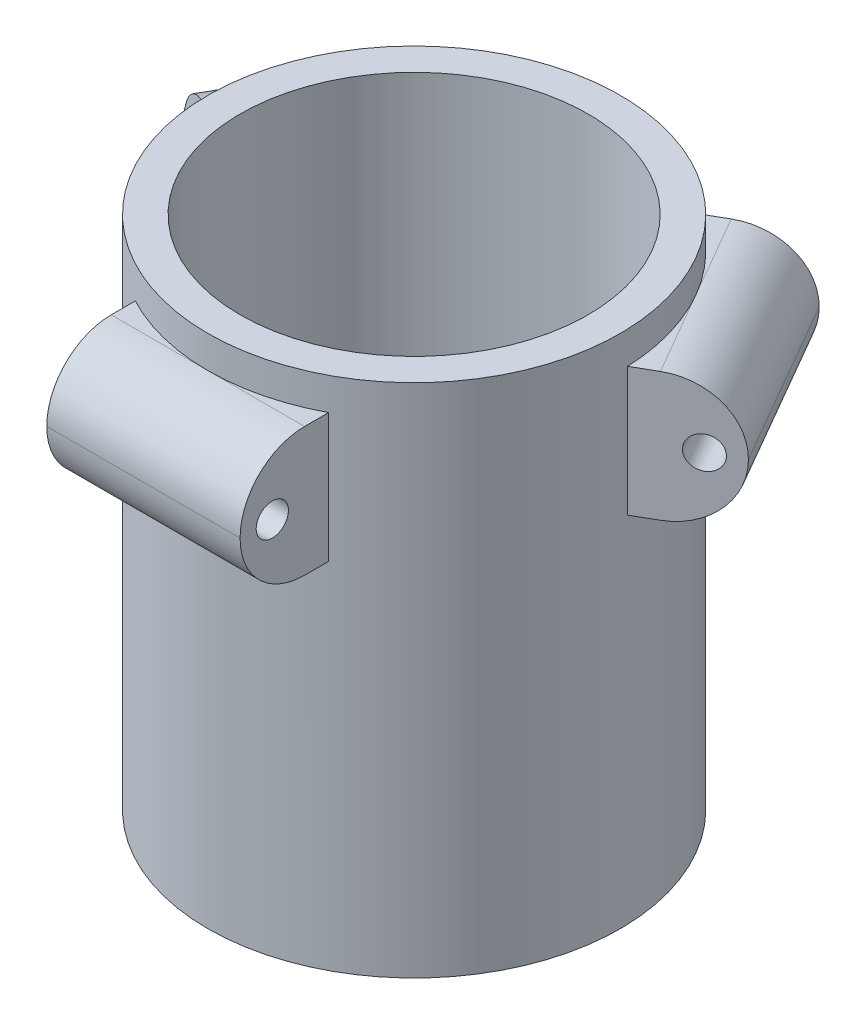
ISO-10303-21;
HEADER;
FILE_DESCRIPTION(('STEP AP214'),'2;1');
FILE_NAME('part.step','',(''),(''),'','','');
FILE_SCHEMA(('AUTOMOTIVE_DESIGN { 1 0 10303 214 1 1 1 1 }'));
ENDSEC;
DATA;
#1=APPLICATION_CONTEXT('core data for automotive mechanical design processes');
#2=APPLICATION_PROTOCOL_DEFINITION('international standard','automotive_design',2000,#1);
#3=PRODUCT_CONTEXT('',#1,'mechanical');
#4=PRODUCT('Part','Part','',(#3));
#5=PRODUCT_RELATED_PRODUCT_CATEGORY('part','',(#4));
#6=PRODUCT_DEFINITION_FORMATION('','',#4);
#7=PRODUCT_DEFINITION_CONTEXT('part definition',#1,'design');
#8=PRODUCT_DEFINITION('design','',#6,#7);
#9=PRODUCT_DEFINITION_SHAPE('','',#8);
#10=(LENGTH_UNIT() NAMED_UNIT(*) SI_UNIT(.MILLI.,.METRE.));
#11=(NAMED_UNIT(*) PLANE_ANGLE_UNIT() SI_UNIT($,.RADIAN.));
#12=(NAMED_UNIT(*) SI_UNIT($,.STERADIAN.) SOLID_ANGLE_UNIT());
#13=UNCERTAINTY_MEASURE_WITH_UNIT(LENGTH_MEASURE(1.E-05),#10,'distance_accuracy_value','');
#14=(GEOMETRIC_REPRESENTATION_CONTEXT(3) GLOBAL_UNCERTAINTY_ASSIGNED_CONTEXT((#13)) GLOBAL_UNIT_ASSIGNED_CONTEXT((#10,
#11,#12)) REPRESENTATION_CONTEXT('',''));
#15=CARTESIAN_POINT('',(0.,0.,0.));
#16=DIRECTION('',(0.,0.,1.));
#17=DIRECTION('',(1.,0.,0.));
#18=AXIS2_PLACEMENT_3D('',#15,#16,#17);
#19=CARTESIAN_POINT('',(0.,34.925,0.));
#20=DIRECTION('',(0.,-1.,0.));
#21=DIRECTION('',(0.866025403784443,0.,0.499999999999992));
#22=AXIS2_PLACEMENT_3D('',#19,#20,#21);
#23=PLANE('',#22);
#24=DIRECTION('',(-0.866025403784443,0.,-0.499999999999992));
#25=VECTOR('',#24,1.);
#26=CARTESIAN_POINT('',(-4.76249999999992,34.925,8.24889197104682));
#27=LINE('',#26,#25);
#28=CARTESIAN_POINT('',(-20.3070354144149,34.925,-0.725749734893167));
#29=VERTEX_POINT('',#28);
#30=CARTESIAN_POINT('',(-22.3601362048998,34.925,-1.91110802895301));
#31=VERTEX_POINT('',#30);
#32=EDGE_CURVE('E180',#29,#31,#27,.T.);
#33=ORIENTED_EDGE('',*,*,#32,.T.);
#34=DIRECTION('',(0.499999999999992,0.,-0.866025403784443));
#35=VECTOR('',#34,1.);
#36=CARTESIAN_POINT('',(-17.5976362048999,34.925,-10.1599999999998));
#37=LINE('',#36,#35);
#38=CARTESIAN_POINT('',(-17.5976362048999,34.925,-10.1599999999998));
#39=VERTEX_POINT('',#38);
#40=EDGE_CURVE('E11',#31,#39,#37,.T.);
#41=ORIENTED_EDGE('',*,*,#40,.T.);
#42=CARTESIAN_POINT('',(0.,34.925,0.));
#43=DIRECTION('',(0.,-1.,0.));
#44=DIRECTION('',(0.866025403784443,0.,0.499999999999992));
#45=AXIS2_PLACEMENT_3D('',#42,#43,#44);
#46=CIRCLE('',#45,20.32);
#47=EDGE_CURVE('E337',#29,#39,#46,.T.);
#48=ORIENTED_EDGE('',*,*,#47,.F.);
#49=EDGE_LOOP('',(#33,#41,#48));
#50=FACE_BOUND('',#49,.T.);
#51=ADVANCED_FACE('F34',(#50),#23,.T.);
#52=CARTESIAN_POINT('',(0.,47.625,0.));
#53=DIRECTION('',(0.,-1.,0.));
#54=DIRECTION('',(0.866025403784443,0.,0.499999999999992));
#55=AXIS2_PLACEMENT_3D('',#52,#53,#54);
#56=PLANE('',#55);
#57=DIRECTION('',(-0.866025403784443,0.,-0.499999999999992));
#58=VECTOR('',#57,1.);
#59=CARTESIAN_POINT('',(4.76249999999992,47.625,-8.24889197104681));
#60=LINE('',#59,#58);
#61=CARTESIAN_POINT('',(-10.7820354144151,47.625,-17.2235336769868));
#62=VERTEX_POINT('',#61);
#63=CARTESIAN_POINT('',(-12.8351362049,47.625,-18.4088919710467));
#64=VERTEX_POINT('',#63);
#65=EDGE_CURVE('E164',#62,#64,#60,.T.);
#66=ORIENTED_EDGE('',*,*,#65,.T.);
#67=DIRECTION('',(0.499999999999992,0.,-0.866025403784443));
#68=VECTOR('',#67,1.);
#69=CARTESIAN_POINT('',(-22.3601362048998,47.625,-1.91110802895302));
#70=LINE('',#69,#68);
#71=CARTESIAN_POINT('',(-17.5976362048999,47.625,-10.1599999999998));
#72=VERTEX_POINT('',#71);
#73=EDGE_CURVE('E166',#64,#72,#70,.F.);
#74=ORIENTED_EDGE('',*,*,#73,.T.);
#75=CARTESIAN_POINT('',(0.,47.625,0.));
#76=DIRECTION('',(0.,-1.,0.));
#77=DIRECTION('',(0.866025403784443,0.,0.499999999999992));
#78=AXIS2_PLACEMENT_3D('',#75,#76,#77);
#79=CIRCLE('',#78,20.32);
#80=EDGE_CURVE('E161',#72,#62,#79,.T.);
#81=ORIENTED_EDGE('',*,*,#80,.T.);
#82=EDGE_LOOP('',(#66,#74,#81));
#83=FACE_BOUND('',#82,.T.);
#84=ADVANCED_FACE('F163',(#83),#56,.F.);
#85=CARTESIAN_POINT('',(0.,34.925,0.));
#86=DIRECTION('',(0.,-1.,0.));
#87=DIRECTION('',(-0.866025403784436,0.,0.500000000000004));
#88=AXIS2_PLACEMENT_3D('',#85,#86,#87);
#89=PLANE('',#88);
#90=DIRECTION('',(0.866025403784436,0.,-0.500000000000004));
#91=VECTOR('',#90,1.);
#92=CARTESIAN_POINT('',(-4.76250000000004,34.925,-8.24889197104676));
#93=LINE('',#92,#91);
#94=CARTESIAN_POINT('',(10.7820354144149,34.925,-17.223533676987));
#95=VERTEX_POINT('',#94);
#96=CARTESIAN_POINT('',(12.8351362048997,34.925,-18.4088919710468));
#97=VERTEX_POINT('',#96);
#98=EDGE_CURVE('E199',#95,#97,#93,.T.);
#99=ORIENTED_EDGE('',*,*,#98,.T.);
#100=DIRECTION('',(0.500000000000004,0.,0.866025403784436));
#101=VECTOR('',#100,1.);
#102=CARTESIAN_POINT('',(17.5976362048998,34.925,-10.1600000000001));
#103=LINE('',#102,#101);
#104=CARTESIAN_POINT('',(17.5976362048998,34.925,-10.1600000000001));
#105=VERTEX_POINT('',#104);
#106=EDGE_CURVE('E305',#97,#105,#103,.T.);
#107=ORIENTED_EDGE('',*,*,#106,.T.);
#108=CARTESIAN_POINT('',(0.,34.925,0.));
#109=DIRECTION('',(0.,-1.,0.));
#110=DIRECTION('',(-0.866025403784436,0.,0.500000000000004));
#111=AXIS2_PLACEMENT_3D('',#108,#109,#110);
#112=CIRCLE('',#111,20.32);
#113=EDGE_CURVE('E210',#95,#105,#112,.T.);
#114=ORIENTED_EDGE('',*,*,#113,.F.);
#115=EDGE_LOOP('',(#99,#107,#114));
#116=FACE_BOUND('',#115,.T.);
#117=ADVANCED_FACE('F345',(#116),#89,.T.);
#118=CARTESIAN_POINT('',(0.,47.625,0.));
#119=DIRECTION('',(0.,-1.,0.));
#120=DIRECTION('',(-0.866025403784436,0.,0.500000000000004));
#121=AXIS2_PLACEMENT_3D('',#118,#119,#120);
#122=PLANE('',#121);
#123=DIRECTION('',(0.866025403784437,0.,-0.500000000000004));
#124=VECTOR('',#123,1.);
#125=CARTESIAN_POINT('',(4.76250000000003,47.625,8.24889197104675));
#126=LINE('',#125,#124);
#127=CARTESIAN_POINT('',(20.3070354144149,47.625,-0.725749734893456));
#128=VERTEX_POINT('',#127);
#129=CARTESIAN_POINT('',(22.3601362048998,47.625,-1.91110802895334));
#130=VERTEX_POINT('',#129);
#131=EDGE_CURVE('E195',#128,#130,#126,.T.);
#132=ORIENTED_EDGE('',*,*,#131,.T.);
#133=DIRECTION('',(0.500000000000004,0.,0.866025403784436));
#134=VECTOR('',#133,1.);
#135=CARTESIAN_POINT('',(12.8351362048997,47.625,-18.4088919710468));
#136=LINE('',#135,#134);
#137=CARTESIAN_POINT('',(17.5976362048998,47.625,-10.1600000000001));
#138=VERTEX_POINT('',#137);
#139=EDGE_CURVE('E296',#130,#138,#136,.F.);
#140=ORIENTED_EDGE('',*,*,#139,.T.);
#141=CARTESIAN_POINT('',(0.,47.625,0.));
#142=DIRECTION('',(0.,-1.,0.));
#143=DIRECTION('',(-0.866025403784436,0.,0.500000000000004));
#144=AXIS2_PLACEMENT_3D('',#141,#142,#143);
#145=CIRCLE('',#144,20.32);
#146=EDGE_CURVE('E198',#138,#128,#145,.T.);
#147=ORIENTED_EDGE('',*,*,#146,.T.);
#148=EDGE_LOOP('',(#132,#140,#147));
#149=FACE_BOUND('',#148,.T.);
#150=ADVANCED_FACE('F401',(#149),#122,.F.);
#151=CARTESIAN_POINT('',(0.,50.8,0.));
#152=DIRECTION('',(0.,-1.,0.));
#153=DIRECTION('',(0.,0.,-1.));
#154=AXIS2_PLACEMENT_3D('',#151,#152,#153);
#155=CYLINDRICAL_SURFACE('',#154,20.32);
#156=CARTESIAN_POINT('',(10.7820354144149,47.625,-17.223533676987));
#157=VERTEX_POINT('',#156);
#158=EDGE_CURVE('E200',#157,#138,#145,.T.);
#159=ORIENTED_EDGE('',*,*,#158,.F.);
#160=DIRECTION('',(0.,-1.,0.));
#161=VECTOR('',#160,1.);
#162=CARTESIAN_POINT('',(10.7820354144149,47.625,-17.223533676987));
#163=LINE('',#162,#161);
#164=EDGE_CURVE('E215',#157,#95,#163,.T.);
#165=ORIENTED_EDGE('',*,*,#164,.T.);
#166=ORIENTED_EDGE('',*,*,#113,.T.);
#167=CARTESIAN_POINT('',(20.3070354144149,34.925,-0.725749734893449));
#168=VERTEX_POINT('',#167);
#169=EDGE_CURVE('E209',#105,#168,#112,.T.);
#170=ORIENTED_EDGE('',*,*,#169,.T.);
#171=DIRECTION('',(0.,-1.,0.));
#172=VECTOR('',#171,1.);
#173=CARTESIAN_POINT('',(20.3070354144149,47.625,-0.725749734893456));
#174=LINE('',#173,#172);
#175=EDGE_CURVE('E206',#128,#168,#174,.T.);
#176=ORIENTED_EDGE('',*,*,#175,.F.);
#177=ORIENTED_EDGE('',*,*,#146,.F.);
#178=EDGE_LOOP('',(#159,#165,#166,#170,#176,#177));
#179=FACE_BOUND('',#178,.T.);
#180=CARTESIAN_POINT('',(0.,0.,0.));
#181=DIRECTION('',(0.,1.,0.));
#182=DIRECTION('',(0.,0.,1.));
#183=AXIS2_PLACEMENT_3D('',#180,#181,#182);
#184=CIRCLE('',#183,20.32);
#185=CARTESIAN_POINT('',(0.,0.,20.32));
#186=VERTEX_POINT('',#185);
#187=EDGE_CURVE('E263',#186,#186,#184,.T.);
#188=ORIENTED_EDGE('',*,*,#187,.T.);
#189=EDGE_LOOP('',(#188));
#190=FACE_BOUND('',#189,.T.);
#191=CARTESIAN_POINT('',(0.,50.8,0.));
#192=DIRECTION('',(0.,1.,0.));
#193=DIRECTION('',(0.,0.,1.));
#194=AXIS2_PLACEMENT_3D('',#191,#192,#193);
#195=CIRCLE('',#194,20.32);
#196=CARTESIAN_POINT('',(0.,50.8,20.32));
#197=VERTEX_POINT('',#196);
#198=EDGE_CURVE('E264',#197,#197,#195,.T.);
#199=ORIENTED_EDGE('',*,*,#198,.F.);
#200=EDGE_LOOP('',(#199));
#201=FACE_BOUND('',#200,.T.);
#202=CARTESIAN_POINT('',(0.,47.625,0.));
#203=DIRECTION('',(0.,-1.,0.));
#204=DIRECTION('',(0.,0.,-1.));
#205=AXIS2_PLACEMENT_3D('',#202,#203,#204);
#206=CIRCLE('',#205,20.32);
#207=CARTESIAN_POINT('',(9.525,47.625,17.9492834118803));
#208=VERTEX_POINT('',#207);
#209=CARTESIAN_POINT('',(0.,47.625,20.32));
#210=VERTEX_POINT('',#209);
#211=EDGE_CURVE('E233',#208,#210,#206,.T.);
#212=ORIENTED_EDGE('',*,*,#211,.F.);
#213=DIRECTION('',(0.,-1.,0.));
#214=VECTOR('',#213,1.);
#215=CARTESIAN_POINT('',(9.525,47.625,17.9492834118803));
#216=LINE('',#215,#214);
#217=CARTESIAN_POINT('',(9.525,34.925,17.9492834118803));
#218=VERTEX_POINT('',#217);
#219=EDGE_CURVE('E248',#208,#218,#216,.T.);
#220=ORIENTED_EDGE('',*,*,#219,.T.);
#221=CARTESIAN_POINT('',(0.,34.925,0.));
#222=DIRECTION('',(0.,-1.,0.));
#223=DIRECTION('',(0.,0.,-1.));
#224=AXIS2_PLACEMENT_3D('',#221,#222,#223);
#225=CIRCLE('',#224,20.32);
#226=CARTESIAN_POINT('',(0.,34.925,20.32));
#227=VERTEX_POINT('',#226);
#228=EDGE_CURVE('E243',#218,#227,#225,.T.);
#229=ORIENTED_EDGE('',*,*,#228,.T.);
#230=CARTESIAN_POINT('',(-9.525,34.925,17.9492834118803));
#231=VERTEX_POINT('',#230);
#232=EDGE_CURVE('E242',#227,#231,#225,.T.);
#233=ORIENTED_EDGE('',*,*,#232,.T.);
#234=DIRECTION('',(0.,-1.,0.));
#235=VECTOR('',#234,1.);
#236=CARTESIAN_POINT('',(-9.525,47.625,17.9492834118803));
#237=LINE('',#236,#235);
#238=CARTESIAN_POINT('',(-9.525,47.625,17.9492834118803));
#239=VERTEX_POINT('',#238);
#240=EDGE_CURVE('E239',#239,#231,#237,.T.);
#241=ORIENTED_EDGE('',*,*,#240,.F.);
#242=EDGE_CURVE('E231',#210,#239,#206,.T.);
#243=ORIENTED_EDGE('',*,*,#242,.F.);
#244=EDGE_LOOP('',(#212,#220,#229,#233,#241,#243));
#245=FACE_BOUND('',#244,.T.);
#246=CARTESIAN_POINT('',(-20.3070354144149,47.625,-0.725749734893167));
#247=VERTEX_POINT('',#246);
#248=EDGE_CURVE('E171',#247,#72,#79,.T.);
#249=ORIENTED_EDGE('',*,*,#248,.F.);
#250=DIRECTION('',(0.,-1.,0.));
#251=VECTOR('',#250,1.);
#252=CARTESIAN_POINT('',(-20.3070354144149,47.625,-0.725749734893167));
#253=LINE('',#252,#251);
#254=EDGE_CURVE('E186',#247,#29,#253,.T.);
#255=ORIENTED_EDGE('',*,*,#254,.T.);
#256=ORIENTED_EDGE('',*,*,#47,.T.);
#257=CARTESIAN_POINT('',(-10.7820354144151,34.925,-17.2235336769868));
#258=VERTEX_POINT('',#257);
#259=EDGE_CURVE('E184',#39,#258,#46,.T.);
#260=ORIENTED_EDGE('',*,*,#259,.T.);
#261=DIRECTION('',(0.,-1.,0.));
#262=VECTOR('',#261,1.);
#263=CARTESIAN_POINT('',(-10.7820354144151,47.625,-17.2235336769868));
#264=LINE('',#263,#262);
#265=EDGE_CURVE('E177',#62,#258,#264,.T.);
#266=ORIENTED_EDGE('',*,*,#265,.F.);
#267=ORIENTED_EDGE('',*,*,#80,.F.);
#268=EDGE_LOOP('',(#249,#255,#256,#260,#266,#267));
#269=FACE_BOUND('',#268,.T.);
#270=ADVANCED_FACE('F182',(#179,#190,#201,#245,#269),#155,.T.);
#271=CARTESIAN_POINT('',(0.,34.925,0.));
#272=DIRECTION('',(0.,-1.,0.));
#273=DIRECTION('',(0.,0.,-1.));
#274=AXIS2_PLACEMENT_3D('',#271,#272,#273);
#275=PLANE('',#274);
#276=DIRECTION('',(0.,0.,1.));
#277=VECTOR('',#276,1.);
#278=CARTESIAN_POINT('',(9.525,34.925,0.));
#279=LINE('',#278,#277);
#280=CARTESIAN_POINT('',(9.525,34.925,20.32));
#281=VERTEX_POINT('',#280);
#282=EDGE_CURVE('E232',#218,#281,#279,.T.);
#283=ORIENTED_EDGE('',*,*,#282,.T.);
#284=DIRECTION('',(-1.,0.,0.));
#285=VECTOR('',#284,1.);
#286=CARTESIAN_POINT('',(0.,34.925,20.32));
#287=LINE('',#286,#285);
#288=EDGE_CURVE('E286',#281,#227,#287,.T.);
#289=ORIENTED_EDGE('',*,*,#288,.T.);
#290=ORIENTED_EDGE('',*,*,#228,.F.);
#291=EDGE_LOOP('',(#283,#289,#290));
#292=FACE_BOUND('',#291,.T.);
#293=ADVANCED_FACE('F425',(#292),#275,.T.);
#294=CARTESIAN_POINT('',(0.,47.625,0.));
#295=DIRECTION('',(0.,-1.,0.));
#296=DIRECTION('',(0.,0.,-1.));
#297=AXIS2_PLACEMENT_3D('',#294,#295,#296);
#298=PLANE('',#297);
#299=DIRECTION('',(0.,0.,1.));
#300=VECTOR('',#299,1.);
#301=CARTESIAN_POINT('',(-9.52499999999999,47.625,0.));
#302=LINE('',#301,#300);
#303=CARTESIAN_POINT('',(-9.525,47.625,20.32));
#304=VERTEX_POINT('',#303);
#305=EDGE_CURVE('E228',#239,#304,#302,.T.);
#306=ORIENTED_EDGE('',*,*,#305,.T.);
#307=DIRECTION('',(-1.,0.,0.));
#308=VECTOR('',#307,1.);
#309=CARTESIAN_POINT('',(9.525,47.625,20.32));
#310=LINE('',#309,#308);
#311=EDGE_CURVE('E277',#304,#210,#310,.F.);
#312=ORIENTED_EDGE('',*,*,#311,.T.);
#313=ORIENTED_EDGE('',*,*,#242,.T.);
#314=EDGE_LOOP('',(#306,#312,#313));
#315=FACE_BOUND('',#314,.T.);
#316=ADVANCED_FACE('F421',(#315),#298,.F.);
#317=CARTESIAN_POINT('',(0.,50.8,0.));
#318=DIRECTION('',(0.,1.,0.));
#319=DIRECTION('',(0.,0.,1.));
#320=AXIS2_PLACEMENT_3D('',#317,#318,#319);
#321=PLANE('',#320);
#322=CARTESIAN_POINT('',(0.,50.8,0.));
#323=DIRECTION('',(0.,1.,0.));
#324=DIRECTION('',(0.,0.,1.));
#325=AXIS2_PLACEMENT_3D('',#322,#323,#324);
#326=CIRCLE('',#325,17.145);
#327=CARTESIAN_POINT('',(0.,50.8,17.145));
#328=VERTEX_POINT('',#327);
#329=EDGE_CURVE('E260',#328,#328,#326,.T.);
#330=ORIENTED_EDGE('',*,*,#329,.F.);
#331=EDGE_LOOP('',(#330));
#332=FACE_BOUND('',#331,.T.);
#333=ORIENTED_EDGE('',*,*,#198,.T.);
#334=EDGE_LOOP('',(#333));
#335=FACE_BOUND('',#334,.T.);
#336=ADVANCED_FACE('F446',(#332,#335),#321,.T.);
#337=CARTESIAN_POINT('',(0.,0.,0.));
#338=DIRECTION('',(0.,1.,0.));
#339=DIRECTION('',(0.,0.,1.));
#340=AXIS2_PLACEMENT_3D('',#337,#338,#339);
#341=PLANE('',#340);
#342=CARTESIAN_POINT('',(0.,0.,0.));
#343=DIRECTION('',(0.,1.,0.));
#344=DIRECTION('',(0.,0.,1.));
#345=AXIS2_PLACEMENT_3D('',#342,#343,#344);
#346=CIRCLE('',#345,4.064);
#347=CARTESIAN_POINT('',(0.,0.,4.064));
#348=VERTEX_POINT('',#347);
#349=EDGE_CURVE('E254',#348,#348,#346,.T.);
#350=ORIENTED_EDGE('',*,*,#349,.T.);
#351=EDGE_LOOP('',(#350));
#352=FACE_BOUND('',#351,.T.);
#353=ORIENTED_EDGE('',*,*,#187,.F.);
#354=EDGE_LOOP('',(#353));
#355=FACE_BOUND('',#354,.T.);
#356=ADVANCED_FACE('F441',(#352,#355),#341,.F.);
#357=CARTESIAN_POINT('',(0.,50.8,0.));
#358=DIRECTION('',(0.,-1.,0.));
#359=DIRECTION('',(0.,0.,-1.));
#360=AXIS2_PLACEMENT_3D('',#357,#358,#359);
#361=CYLINDRICAL_SURFACE('',#360,17.145);
#362=ORIENTED_EDGE('',*,*,#329,.T.);
#363=EDGE_LOOP('',(#362));
#364=FACE_BOUND('',#363,.T.);
#365=CARTESIAN_POINT('',(0.,3.175,0.));
#366=DIRECTION('',(0.,1.,0.));
#367=DIRECTION('',(0.,0.,1.));
#368=AXIS2_PLACEMENT_3D('',#365,#366,#367);
#369=CIRCLE('',#368,17.145);
#370=CARTESIAN_POINT('',(0.,3.175,17.145));
#371=VERTEX_POINT('',#370);
#372=EDGE_CURVE('E257',#371,#371,#369,.T.);
#373=ORIENTED_EDGE('',*,*,#372,.F.);
#374=EDGE_LOOP('',(#373));
#375=FACE_BOUND('',#374,.T.);
#376=ADVANCED_FACE('F438',(#364,#375),#361,.F.);
#377=CARTESIAN_POINT('',(0.,3.175,0.));
#378=DIRECTION('',(0.,1.,0.));
#379=DIRECTION('',(0.,0.,1.));
#380=AXIS2_PLACEMENT_3D('',#377,#378,#379);
#381=PLANE('',#380);
#382=CARTESIAN_POINT('',(0.,3.175,0.));
#383=DIRECTION('',(0.,1.,0.));
#384=DIRECTION('',(0.,0.,1.));
#385=AXIS2_PLACEMENT_3D('',#382,#383,#384);
#386=CIRCLE('',#385,4.064);
#387=CARTESIAN_POINT('',(0.,3.175,4.064));
#388=VERTEX_POINT('',#387);
#389=EDGE_CURVE('E251',#388,#388,#386,.T.);
#390=ORIENTED_EDGE('',*,*,#389,.F.);
#391=EDGE_LOOP('',(#390));
#392=FACE_BOUND('',#391,.T.);
#393=ORIENTED_EDGE('',*,*,#372,.T.);
#394=EDGE_LOOP('',(#393));
#395=FACE_BOUND('',#394,.T.);
#396=ADVANCED_FACE('F436',(#392,#395),#381,.T.);
#397=CARTESIAN_POINT('',(0.,-43.307,0.));
#398=DIRECTION('',(0.,1.,0.));
#399=DIRECTION('',(0.,0.,1.));
#400=AXIS2_PLACEMENT_3D('',#397,#398,#399);
#401=CYLINDRICAL_SURFACE('',#400,4.064);
#402=ORIENTED_EDGE('',*,*,#389,.T.);
#403=EDGE_LOOP('',(#402));
#404=FACE_BOUND('',#403,.T.);
#405=ORIENTED_EDGE('',*,*,#349,.F.);
#406=EDGE_LOOP('',(#405));
#407=FACE_BOUND('',#406,.T.);
#408=ADVANCED_FACE('F432',(#404,#407),#401,.F.);
#409=CARTESIAN_POINT('',(-9.52499999999999,47.625,0.));
#410=DIRECTION('',(1.,0.,0.));
#411=DIRECTION('',(0.,0.,-1.));
#412=AXIS2_PLACEMENT_3D('',#409,#410,#411);
#413=PLANE('',#412);
#414=CARTESIAN_POINT('',(-9.525,41.275,23.495));
#415=DIRECTION('',(1.,0.,0.));
#416=DIRECTION('',(0.,0.,-1.));
#417=AXIS2_PLACEMENT_3D('',#414,#415,#416);
#418=CIRCLE('',#417,1.5875);
#419=CARTESIAN_POINT('',(-9.525,41.275,21.9075));
#420=VERTEX_POINT('',#419);
#421=EDGE_CURVE('E224',#420,#420,#418,.F.);
#422=ORIENTED_EDGE('',*,*,#421,.F.);
#423=EDGE_LOOP('',(#422));
#424=FACE_BOUND('',#423,.T.);
#425=CARTESIAN_POINT('',(-9.525,41.275,20.32));
#426=DIRECTION('',(1.,0.,0.));
#427=DIRECTION('',(0.,0.,-1.));
#428=AXIS2_PLACEMENT_3D('',#425,#426,#427);
#429=CIRCLE('',#428,6.35);
#430=CARTESIAN_POINT('',(-9.525,34.925,20.32));
#431=VERTEX_POINT('',#430);
#432=CARTESIAN_POINT('',(-9.525,41.275,26.67));
#433=VERTEX_POINT('',#432);
#434=EDGE_CURVE('E267',#431,#433,#429,.F.);
#435=ORIENTED_EDGE('',*,*,#434,.T.);
#436=CARTESIAN_POINT('',(-9.525,41.275,20.32));
#437=DIRECTION('',(1.,0.,0.));
#438=DIRECTION('',(0.,0.,-1.));
#439=AXIS2_PLACEMENT_3D('',#436,#437,#438);
#440=CIRCLE('',#439,6.35);
#441=EDGE_CURVE('E273',#433,#304,#440,.F.);
#442=ORIENTED_EDGE('',*,*,#441,.T.);
#443=ORIENTED_EDGE('',*,*,#305,.F.);
#444=ORIENTED_EDGE('',*,*,#240,.T.);
#445=DIRECTION('',(0.,0.,1.));
#446=VECTOR('',#445,1.);
#447=CARTESIAN_POINT('',(-9.52499999999999,34.925,0.));
#448=LINE('',#447,#446);
#449=EDGE_CURVE('E227',#231,#431,#448,.T.);
#450=ORIENTED_EDGE('',*,*,#449,.T.);
#451=EDGE_LOOP('',(#435,#442,#443,#444,#450));
#452=FACE_BOUND('',#451,.T.);
#453=ADVANCED_FACE('F428',(#424,#452),#413,.F.);
#454=CARTESIAN_POINT('',(9.525,47.625,0.));
#455=DIRECTION('',(1.,0.,0.));
#456=DIRECTION('',(0.,0.,-1.));
#457=AXIS2_PLACEMENT_3D('',#454,#455,#456);
#458=PLANE('',#457);
#459=CARTESIAN_POINT('',(9.525,41.275,23.495));
#460=DIRECTION('',(1.,0.,0.));
#461=DIRECTION('',(0.,0.,-1.));
#462=AXIS2_PLACEMENT_3D('',#459,#460,#461);
#463=CIRCLE('',#462,1.5875);
#464=CARTESIAN_POINT('',(9.525,41.275,21.9075));
#465=VERTEX_POINT('',#464);
#466=EDGE_CURVE('E221',#465,#465,#463,.T.);
#467=ORIENTED_EDGE('',*,*,#466,.F.);
#468=EDGE_LOOP('',(#467));
#469=FACE_BOUND('',#468,.T.);
#470=DIRECTION('',(0.,0.,1.));
#471=VECTOR('',#470,1.);
#472=CARTESIAN_POINT('',(9.525,47.625,0.));
#473=LINE('',#472,#471);
#474=CARTESIAN_POINT('',(9.525,47.625,20.32));
#475=VERTEX_POINT('',#474);
#476=EDGE_CURVE('E236',#208,#475,#473,.T.);
#477=ORIENTED_EDGE('',*,*,#476,.T.);
#478=CARTESIAN_POINT('',(9.525,41.275,20.32));
#479=DIRECTION('',(1.,0.,0.));
#480=DIRECTION('',(0.,0.,-1.));
#481=AXIS2_PLACEMENT_3D('',#478,#479,#480);
#482=CIRCLE('',#481,6.35);
#483=CARTESIAN_POINT('',(9.525,41.275,26.67));
#484=VERTEX_POINT('',#483);
#485=EDGE_CURVE('E282',#475,#484,#482,.T.);
#486=ORIENTED_EDGE('',*,*,#485,.T.);
#487=CARTESIAN_POINT('',(9.525,41.275,20.32));
#488=DIRECTION('',(1.,0.,0.));
#489=DIRECTION('',(0.,0.,-1.));
#490=AXIS2_PLACEMENT_3D('',#487,#488,#489);
#491=CIRCLE('',#490,6.35);
#492=EDGE_CURVE('E280',#484,#281,#491,.T.);
#493=ORIENTED_EDGE('',*,*,#492,.T.);
#494=ORIENTED_EDGE('',*,*,#282,.F.);
#495=ORIENTED_EDGE('',*,*,#219,.F.);
#496=EDGE_LOOP('',(#477,#486,#493,#494,#495));
#497=FACE_BOUND('',#496,.T.);
#498=ADVANCED_FACE('F419',(#469,#497),#458,.T.);
#499=ORIENTED_EDGE('',*,*,#211,.T.);
#500=DIRECTION('',(-1.,0.,0.));
#501=VECTOR('',#500,1.);
#502=CARTESIAN_POINT('',(9.525,47.625,20.32));
#503=LINE('',#502,#501);
#504=EDGE_CURVE('E275',#210,#475,#503,.F.);
#505=ORIENTED_EDGE('',*,*,#504,.T.);
#506=ORIENTED_EDGE('',*,*,#476,.F.);
#507=EDGE_LOOP('',(#499,#505,#506));
#508=FACE_BOUND('',#507,.T.);
#509=ADVANCED_FACE('F416',(#508),#298,.F.);
#510=ORIENTED_EDGE('',*,*,#232,.F.);
#511=DIRECTION('',(-1.,0.,0.));
#512=VECTOR('',#511,1.);
#513=CARTESIAN_POINT('',(0.,34.925,20.32));
#514=LINE('',#513,#512);
#515=EDGE_CURVE('E284',#227,#431,#514,.T.);
#516=ORIENTED_EDGE('',*,*,#515,.T.);
#517=ORIENTED_EDGE('',*,*,#449,.F.);
#518=EDGE_LOOP('',(#510,#516,#517));
#519=FACE_BOUND('',#518,.T.);
#520=ADVANCED_FACE('F414',(#519),#275,.T.);
#521=CARTESIAN_POINT('',(-14.0151280605346,41.275,23.495));
#522=DIRECTION('',(1.,0.,0.));
#523=DIRECTION('',(0.,0.,-1.));
#524=AXIS2_PLACEMENT_3D('',#521,#522,#523);
#525=CYLINDRICAL_SURFACE('',#524,1.5875);
#526=ORIENTED_EDGE('',*,*,#421,.T.);
#527=EDGE_LOOP('',(#526));
#528=FACE_BOUND('',#527,.T.);
#529=ORIENTED_EDGE('',*,*,#466,.T.);
#530=EDGE_LOOP('',(#529));
#531=FACE_BOUND('',#530,.T.);
#532=ADVANCED_FACE('F410',(#528,#531),#525,.F.);
#533=CARTESIAN_POINT('',(0.,41.275,20.32));
#534=DIRECTION('',(-1.,0.,0.));
#535=DIRECTION('',(0.,0.,1.));
#536=AXIS2_PLACEMENT_3D('',#533,#534,#535);
#537=CYLINDRICAL_SURFACE('',#536,6.35);
#538=ORIENTED_EDGE('',*,*,#288,.F.);
#539=ORIENTED_EDGE('',*,*,#492,.F.);
#540=DIRECTION('',(-1.,0.,0.));
#541=VECTOR('',#540,1.);
#542=CARTESIAN_POINT('',(0.,41.275,26.67));
#543=LINE('',#542,#541);
#544=EDGE_CURVE('E218',#433,#484,#543,.F.);
#545=ORIENTED_EDGE('',*,*,#544,.F.);
#546=ORIENTED_EDGE('',*,*,#434,.F.);
#547=ORIENTED_EDGE('',*,*,#515,.F.);
#548=EDGE_LOOP('',(#538,#539,#545,#546,#547));
#549=FACE_BOUND('',#548,.T.);
#550=ADVANCED_FACE('F413',(#549),#537,.T.);
#551=CARTESIAN_POINT('',(0.,41.275,20.32));
#552=DIRECTION('',(1.,0.,0.));
#553=DIRECTION('',(0.,0.,-1.));
#554=AXIS2_PLACEMENT_3D('',#551,#552,#553);
#555=CYLINDRICAL_SURFACE('',#554,6.35);
#556=ORIENTED_EDGE('',*,*,#504,.F.);
#557=ORIENTED_EDGE('',*,*,#311,.F.);
#558=ORIENTED_EDGE('',*,*,#441,.F.);
#559=ORIENTED_EDGE('',*,*,#544,.T.);
#560=ORIENTED_EDGE('',*,*,#485,.F.);
#561=EDGE_LOOP('',(#556,#557,#558,#559,#560));
#562=FACE_BOUND('',#561,.T.);
#563=ADVANCED_FACE('F408',(#562),#555,.T.);
#564=CARTESIAN_POINT('',(4.76250000000003,47.625,8.24889197104675));
#565=DIRECTION('',(-0.500000000000004,0.,-0.866025403784436));
#566=DIRECTION('',(-0.866025403784437,0.,0.500000000000004));
#567=AXIS2_PLACEMENT_3D('',#564,#565,#566);
#568=PLANE('',#567);
#569=CARTESIAN_POINT('',(25.1097668619154,41.275,-3.49860802895334));
#570=DIRECTION('',(-0.500000000000004,0.,-0.866025403784437));
#571=DIRECTION('',(-0.866025403784436,0.,0.500000000000004));
#572=AXIS2_PLACEMENT_3D('',#569,#570,#571);
#573=CIRCLE('',#572,1.5875);
#574=CARTESIAN_POINT('',(23.7349515334076,41.275,-2.70485802895333));
#575=VERTEX_POINT('',#574);
#576=EDGE_CURVE('E327',#575,#575,#573,.F.);
#577=ORIENTED_EDGE('',*,*,#576,.F.);
#578=EDGE_LOOP('',(#577));
#579=FACE_BOUND('',#578,.T.);
#580=CARTESIAN_POINT('',(22.3601362048998,41.275,-1.91110802895333));
#581=DIRECTION('',(-0.500000000000004,0.,-0.866025403784436));
#582=DIRECTION('',(-0.866025403784437,0.,0.500000000000004));
#583=AXIS2_PLACEMENT_3D('',#580,#581,#582);
#584=CIRCLE('',#583,6.35);
#585=CARTESIAN_POINT('',(22.3601362048998,34.925,-1.91110802895334));
#586=VERTEX_POINT('',#585);
#587=CARTESIAN_POINT('',(27.859397518931,41.275,-5.08610802895336));
#588=VERTEX_POINT('',#587);
#589=EDGE_CURVE('E288',#586,#588,#584,.F.);
#590=ORIENTED_EDGE('',*,*,#589,.T.);
#591=CARTESIAN_POINT('',(22.3601362048998,41.275,-1.91110802895333));
#592=DIRECTION('',(-0.500000000000004,0.,-0.866025403784436));
#593=DIRECTION('',(-0.866025403784437,0.,0.500000000000004));
#594=AXIS2_PLACEMENT_3D('',#591,#592,#593);
#595=CIRCLE('',#594,6.35);
#596=EDGE_CURVE('E292',#588,#130,#595,.F.);
#597=ORIENTED_EDGE('',*,*,#596,.T.);
#598=ORIENTED_EDGE('',*,*,#131,.F.);
#599=ORIENTED_EDGE('',*,*,#175,.T.);
#600=DIRECTION('',(0.866025403784437,0.,-0.500000000000004));
#601=VECTOR('',#600,1.);
#602=CARTESIAN_POINT('',(4.76250000000003,34.925,8.24889197104675));
#603=LINE('',#602,#601);
#604=EDGE_CURVE('E190',#168,#586,#603,.T.);
#605=ORIENTED_EDGE('',*,*,#604,.T.);
#606=EDGE_LOOP('',(#590,#597,#598,#599,#605));
#607=FACE_BOUND('',#606,.T.);
#608=ADVANCED_FACE('F405',(#579,#607),#568,.F.);
#609=CARTESIAN_POINT('',(-4.76250000000004,47.625,-8.24889197104676));
#610=DIRECTION('',(-0.500000000000004,0.,-0.866025403784436));
#611=DIRECTION('',(-0.866025403784436,0.,0.500000000000004));
#612=AXIS2_PLACEMENT_3D('',#609,#610,#611);
#613=PLANE('',#612);
#614=CARTESIAN_POINT('',(15.5847668619153,41.275,-19.9963919710469));
#615=DIRECTION('',(-0.500000000000004,0.,-0.866025403784436));
#616=DIRECTION('',(-0.866025403784436,0.,0.500000000000004));
#617=AXIS2_PLACEMENT_3D('',#614,#615,#616);
#618=CIRCLE('',#617,1.5875);
#619=CARTESIAN_POINT('',(14.2099515334075,41.275,-19.2026419710469));
#620=VERTEX_POINT('',#619);
#621=EDGE_CURVE('E376',#620,#620,#618,.T.);
#622=ORIENTED_EDGE('',*,*,#621,.F.);
#623=EDGE_LOOP('',(#622));
#624=FACE_BOUND('',#623,.T.);
#625=DIRECTION('',(0.866025403784436,0.,-0.500000000000004));
#626=VECTOR('',#625,1.);
#627=CARTESIAN_POINT('',(-4.76250000000004,47.625,-8.24889197104676));
#628=LINE('',#627,#626);
#629=CARTESIAN_POINT('',(12.8351362048997,47.625,-18.4088919710468));
#630=VERTEX_POINT('',#629);
#631=EDGE_CURVE('E203',#157,#630,#628,.T.);
#632=ORIENTED_EDGE('',*,*,#631,.T.);
#633=CARTESIAN_POINT('',(12.8351362048997,41.275,-18.4088919710468));
#634=DIRECTION('',(-0.500000000000004,0.,-0.866025403784436));
#635=DIRECTION('',(-0.866025403784436,0.,0.500000000000004));
#636=AXIS2_PLACEMENT_3D('',#633,#634,#635);
#637=CIRCLE('',#636,6.35);
#638=CARTESIAN_POINT('',(18.3343975189309,41.275,-21.5838919710469));
#639=VERTEX_POINT('',#638);
#640=EDGE_CURVE('E301',#630,#639,#637,.T.);
#641=ORIENTED_EDGE('',*,*,#640,.T.);
#642=CARTESIAN_POINT('',(12.8351362048997,41.275,-18.4088919710468));
#643=DIRECTION('',(-0.500000000000004,0.,-0.866025403784436));
#644=DIRECTION('',(-0.866025403784436,0.,0.500000000000004));
#645=AXIS2_PLACEMENT_3D('',#642,#643,#644);
#646=CIRCLE('',#645,6.35);
#647=EDGE_CURVE('E299',#639,#97,#646,.T.);
#648=ORIENTED_EDGE('',*,*,#647,.T.);
#649=ORIENTED_EDGE('',*,*,#98,.F.);
#650=ORIENTED_EDGE('',*,*,#164,.F.);
#651=EDGE_LOOP('',(#632,#641,#648,#649,#650));
#652=FACE_BOUND('',#651,.T.);
#653=ADVANCED_FACE('F399',(#624,#652),#613,.T.);
#654=ORIENTED_EDGE('',*,*,#158,.T.);
#655=DIRECTION('',(0.500000000000004,0.,0.866025403784436));
#656=VECTOR('',#655,1.);
#657=CARTESIAN_POINT('',(12.8351362048997,47.625,-18.4088919710468));
#658=LINE('',#657,#656);
#659=EDGE_CURVE('E294',#138,#630,#658,.F.);
#660=ORIENTED_EDGE('',*,*,#659,.T.);
#661=ORIENTED_EDGE('',*,*,#631,.F.);
#662=EDGE_LOOP('',(#654,#660,#661));
#663=FACE_BOUND('',#662,.T.);
#664=ADVANCED_FACE('F394',(#663),#122,.F.);
#665=ORIENTED_EDGE('',*,*,#169,.F.);
#666=DIRECTION('',(0.500000000000004,0.,0.866025403784436));
#667=VECTOR('',#666,1.);
#668=CARTESIAN_POINT('',(17.5976362048998,34.925,-10.1600000000001));
#669=LINE('',#668,#667);
#670=EDGE_CURVE('E303',#105,#586,#669,.T.);
#671=ORIENTED_EDGE('',*,*,#670,.T.);
#672=ORIENTED_EDGE('',*,*,#604,.F.);
#673=EDGE_LOOP('',(#665,#671,#672));
#674=FACE_BOUND('',#673,.T.);
#675=ADVANCED_FACE('F389',(#674),#89,.T.);
#676=CARTESIAN_POINT('',(4.76249999999992,47.625,-8.24889197104681));
#677=DIRECTION('',(-0.499999999999992,0.,0.866025403784443));
#678=DIRECTION('',(0.866025403784443,0.,0.499999999999992));
#679=AXIS2_PLACEMENT_3D('',#676,#677,#678);
#680=PLANE('',#679);
#681=CARTESIAN_POINT('',(-15.5847668619156,41.275,-19.9963919710466));
#682=DIRECTION('',(-0.499999999999992,0.,0.866025403784443));
#683=DIRECTION('',(0.866025403784443,0.,0.499999999999992));
#684=AXIS2_PLACEMENT_3D('',#681,#682,#683);
#685=CIRCLE('',#684,1.5875);
#686=CARTESIAN_POINT('',(-14.2099515334078,41.275,-19.2026419710466));
#687=VERTEX_POINT('',#686);
#688=EDGE_CURVE('E378',#687,#687,#685,.F.);
#689=ORIENTED_EDGE('',*,*,#688,.F.);
#690=EDGE_LOOP('',(#689));
#691=FACE_BOUND('',#690,.T.);
#692=CARTESIAN_POINT('',(-12.8351362049,41.275,-18.4088919710467));
#693=DIRECTION('',(-0.499999999999992,0.,0.866025403784443));
#694=DIRECTION('',(0.866025403784443,0.,0.499999999999992));
#695=AXIS2_PLACEMENT_3D('',#692,#693,#694);
#696=CIRCLE('',#695,6.35);
#697=CARTESIAN_POINT('',(-12.8351362049,34.925,-18.4088919710467));
#698=VERTEX_POINT('',#697);
#699=CARTESIAN_POINT('',(-18.3343975189312,41.275,-21.5838919710466));
#700=VERTEX_POINT('',#699);
#701=EDGE_CURVE('E307',#698,#700,#696,.F.);
#702=ORIENTED_EDGE('',*,*,#701,.T.);
#703=CARTESIAN_POINT('',(-12.8351362049,41.275,-18.4088919710467));
#704=DIRECTION('',(-0.499999999999992,0.,0.866025403784443));
#705=DIRECTION('',(0.866025403784443,0.,0.499999999999992));
#706=AXIS2_PLACEMENT_3D('',#703,#704,#705);
#707=CIRCLE('',#706,6.35);
#708=EDGE_CURVE('E179',#700,#64,#707,.F.);
#709=ORIENTED_EDGE('',*,*,#708,.T.);
#710=ORIENTED_EDGE('',*,*,#65,.F.);
#711=ORIENTED_EDGE('',*,*,#265,.T.);
#712=DIRECTION('',(-0.866025403784443,0.,-0.499999999999992));
#713=VECTOR('',#712,1.);
#714=CARTESIAN_POINT('',(4.76249999999992,34.925,-8.24889197104681));
#715=LINE('',#714,#713);
#716=EDGE_CURVE('E323',#258,#698,#715,.T.);
#717=ORIENTED_EDGE('',*,*,#716,.T.);
#718=EDGE_LOOP('',(#702,#709,#710,#711,#717));
#719=FACE_BOUND('',#718,.T.);
#720=ADVANCED_FACE('F175',(#691,#719),#680,.F.);
#721=CARTESIAN_POINT('',(-4.76249999999992,47.625,8.24889197104682));
#722=DIRECTION('',(-0.499999999999992,0.,0.866025403784443));
#723=DIRECTION('',(0.866025403784443,0.,0.499999999999992));
#724=AXIS2_PLACEMENT_3D('',#721,#722,#723);
#725=PLANE('',#724);
#726=CARTESIAN_POINT('',(-25.1097668619154,41.275,-3.49860802895299));
#727=DIRECTION('',(-0.499999999999992,0.,0.866025403784443));
#728=DIRECTION('',(0.866025403784443,0.,0.499999999999992));
#729=AXIS2_PLACEMENT_3D('',#726,#727,#728);
#730=CIRCLE('',#729,1.5875);
#731=CARTESIAN_POINT('',(-23.7349515334076,41.275,-2.704858028953));
#732=VERTEX_POINT('',#731);
#733=EDGE_CURVE('E311',#732,#732,#730,.T.);
#734=ORIENTED_EDGE('',*,*,#733,.F.);
#735=EDGE_LOOP('',(#734));
#736=FACE_BOUND('',#735,.T.);
#737=DIRECTION('',(-0.866025403784443,0.,-0.499999999999992));
#738=VECTOR('',#737,1.);
#739=CARTESIAN_POINT('',(-4.76249999999992,47.625,8.24889197104682));
#740=LINE('',#739,#738);
#741=CARTESIAN_POINT('',(-22.3601362048998,47.625,-1.91110802895301));
#742=VERTEX_POINT('',#741);
#743=EDGE_CURVE('E187',#247,#742,#740,.T.);
#744=ORIENTED_EDGE('',*,*,#743,.T.);
#745=CARTESIAN_POINT('',(-22.3601362048998,41.275,-1.91110802895301));
#746=DIRECTION('',(-0.499999999999992,0.,0.866025403784443));
#747=DIRECTION('',(0.866025403784443,0.,0.499999999999992));
#748=AXIS2_PLACEMENT_3D('',#745,#746,#747);
#749=CIRCLE('',#748,6.35);
#750=CARTESIAN_POINT('',(-27.859397518931,41.275,-5.08610802895296));
#751=VERTEX_POINT('',#750);
#752=EDGE_CURVE('E56',#742,#751,#749,.T.);
#753=ORIENTED_EDGE('',*,*,#752,.T.);
#754=CARTESIAN_POINT('',(-22.3601362048998,41.275,-1.91110802895301));
#755=DIRECTION('',(-0.499999999999992,0.,0.866025403784443));
#756=DIRECTION('',(0.866025403784443,0.,0.499999999999992));
#757=AXIS2_PLACEMENT_3D('',#754,#755,#756);
#758=CIRCLE('',#757,6.35);
#759=EDGE_CURVE('E317',#751,#31,#758,.T.);
#760=ORIENTED_EDGE('',*,*,#759,.T.);
#761=ORIENTED_EDGE('',*,*,#32,.F.);
#762=ORIENTED_EDGE('',*,*,#254,.F.);
#763=EDGE_LOOP('',(#744,#753,#760,#761,#762));
#764=FACE_BOUND('',#763,.T.);
#765=ADVANCED_FACE('F335',(#736,#764),#725,.T.);
#766=ORIENTED_EDGE('',*,*,#248,.T.);
#767=DIRECTION('',(0.499999999999992,0.,-0.866025403784443));
#768=VECTOR('',#767,1.);
#769=CARTESIAN_POINT('',(-22.3601362048998,47.625,-1.91110802895302));
#770=LINE('',#769,#768);
#771=EDGE_CURVE('E314',#72,#742,#770,.F.);
#772=ORIENTED_EDGE('',*,*,#771,.T.);
#773=ORIENTED_EDGE('',*,*,#743,.F.);
#774=EDGE_LOOP('',(#766,#772,#773));
#775=FACE_BOUND('',#774,.T.);
#776=ADVANCED_FACE('F334',(#775),#56,.F.);
#777=ORIENTED_EDGE('',*,*,#259,.F.);
#778=DIRECTION('',(0.499999999999992,0.,-0.866025403784443));
#779=VECTOR('',#778,1.);
#780=CARTESIAN_POINT('',(-17.5976362048999,34.925,-10.1599999999998));
#781=LINE('',#780,#779);
#782=EDGE_CURVE('E43',#39,#698,#781,.T.);
#783=ORIENTED_EDGE('',*,*,#782,.T.);
#784=ORIENTED_EDGE('',*,*,#716,.F.);
#785=EDGE_LOOP('',(#777,#783,#784));
#786=FACE_BOUND('',#785,.T.);
#787=ADVANCED_FACE('F322',(#786),#23,.T.);
#788=CARTESIAN_POINT('',(-6.15740395459907,41.275,-36.3250635079094));
#789=DIRECTION('',(-0.499999999999992,0.,0.866025403784443));
#790=DIRECTION('',(0.866025403784443,0.,0.499999999999992));
#791=AXIS2_PLACEMENT_3D('',#788,#789,#790);
#792=CYLINDRICAL_SURFACE('',#791,1.5875);
#793=ORIENTED_EDGE('',*,*,#688,.T.);
#794=EDGE_LOOP('',(#793));
#795=FACE_BOUND('',#794,.T.);
#796=ORIENTED_EDGE('',*,*,#733,.T.);
#797=EDGE_LOOP('',(#796));
#798=FACE_BOUND('',#797,.T.);
#799=ADVANCED_FACE('F349',(#795,#798),#792,.F.);
#800=CARTESIAN_POINT('',(44.0621297692315,41.275,29.3278474500016));
#801=DIRECTION('',(-0.500000000000004,0.,-0.866025403784436));
#802=DIRECTION('',(-0.866025403784436,0.,0.500000000000004));
#803=AXIS2_PLACEMENT_3D('',#800,#801,#802);
#804=CYLINDRICAL_SURFACE('',#803,1.5875);
#805=ORIENTED_EDGE('',*,*,#576,.T.);
#806=EDGE_LOOP('',(#805));
#807=FACE_BOUND('',#806,.T.);
#808=ORIENTED_EDGE('',*,*,#621,.T.);
#809=EDGE_LOOP('',(#808));
#810=FACE_BOUND('',#809,.T.);
#811=ADVANCED_FACE('F354',(#807,#810),#804,.F.);
#812=CARTESIAN_POINT('',(17.5976362048998,41.275,-10.1600000000001));
#813=DIRECTION('',(0.500000000000004,0.,0.866025403784436));
#814=DIRECTION('',(0.866025403784436,0.,-0.500000000000004));
#815=AXIS2_PLACEMENT_3D('',#812,#813,#814);
#816=CYLINDRICAL_SURFACE('',#815,6.35);
#817=ORIENTED_EDGE('',*,*,#106,.F.);
#818=ORIENTED_EDGE('',*,*,#647,.F.);
#819=DIRECTION('',(0.500000000000004,0.,0.866025403784436));
#820=VECTOR('',#819,1.);
#821=CARTESIAN_POINT('',(23.0968975189309,41.275,-13.3350000000001));
#822=LINE('',#821,#820);
#823=EDGE_CURVE('E308',#588,#639,#822,.F.);
#824=ORIENTED_EDGE('',*,*,#823,.F.);
#825=ORIENTED_EDGE('',*,*,#589,.F.);
#826=ORIENTED_EDGE('',*,*,#670,.F.);
#827=EDGE_LOOP('',(#817,#818,#824,#825,#826));
#828=FACE_BOUND('',#827,.T.);
#829=ADVANCED_FACE('F363',(#828),#816,.T.);
#830=CARTESIAN_POINT('',(17.5976362048998,41.275,-10.1600000000001));
#831=DIRECTION('',(-0.500000000000004,0.,-0.866025403784436));
#832=DIRECTION('',(-0.866025403784436,0.,0.500000000000004));
#833=AXIS2_PLACEMENT_3D('',#830,#831,#832);
#834=CYLINDRICAL_SURFACE('',#833,6.35);
#835=ORIENTED_EDGE('',*,*,#659,.F.);
#836=ORIENTED_EDGE('',*,*,#139,.F.);
#837=ORIENTED_EDGE('',*,*,#596,.F.);
#838=ORIENTED_EDGE('',*,*,#823,.T.);
#839=ORIENTED_EDGE('',*,*,#640,.F.);
#840=EDGE_LOOP('',(#835,#836,#837,#838,#839));
#841=FACE_BOUND('',#840,.T.);
#842=ADVANCED_FACE('F368',(#841),#834,.T.);
#843=CARTESIAN_POINT('',(-17.5976362048999,41.275,-10.1599999999998));
#844=DIRECTION('',(0.499999999999992,0.,-0.866025403784443));
#845=DIRECTION('',(-0.866025403784443,0.,-0.499999999999992));
#846=AXIS2_PLACEMENT_3D('',#843,#844,#845);
#847=CYLINDRICAL_SURFACE('',#846,6.35);
#848=ORIENTED_EDGE('',*,*,#40,.F.);
#849=ORIENTED_EDGE('',*,*,#759,.F.);
#850=DIRECTION('',(0.499999999999992,0.,-0.866025403784443));
#851=VECTOR('',#850,1.);
#852=CARTESIAN_POINT('',(-23.0968975189311,41.275,-13.3349999999998));
#853=LINE('',#852,#851);
#854=EDGE_CURVE('E38',#700,#751,#853,.F.);
#855=ORIENTED_EDGE('',*,*,#854,.F.);
#856=ORIENTED_EDGE('',*,*,#701,.F.);
#857=ORIENTED_EDGE('',*,*,#782,.F.);
#858=EDGE_LOOP('',(#848,#849,#855,#856,#857));
#859=FACE_BOUND('',#858,.T.);
#860=ADVANCED_FACE('F36',(#859),#847,.T.);
#861=CARTESIAN_POINT('',(-17.5976362048999,41.275,-10.1599999999998));
#862=DIRECTION('',(-0.499999999999992,0.,0.866025403784443));
#863=DIRECTION('',(0.866025403784443,0.,0.499999999999992));
#864=AXIS2_PLACEMENT_3D('',#861,#862,#863);
#865=CYLINDRICAL_SURFACE('',#864,6.35);
#866=ORIENTED_EDGE('',*,*,#771,.F.);
#867=ORIENTED_EDGE('',*,*,#73,.F.);
#868=ORIENTED_EDGE('',*,*,#708,.F.);
#869=ORIENTED_EDGE('',*,*,#854,.T.);
#870=ORIENTED_EDGE('',*,*,#752,.F.);
#871=EDGE_LOOP('',(#866,#867,#868,#869,#870));
#872=FACE_BOUND('',#871,.T.);
#873=ADVANCED_FACE('F331',(#872),#865,.T.);
#874=CLOSED_SHELL('',(#51,#84,#117,#150,#270,#293,#316,#336,#356,#376,#396,#408,#453,#498,#509,
#520,#532,#550,#563,#608,#653,#664,#675,#720,#765,#776,#787,#799,#811,#829,#842,#860,#873));
#875=MANIFOLD_SOLID_BREP('B2',#874);
#876=ADVANCED_BREP_SHAPE_REPRESENTATION('',(#18,#875),#14);
#877=SHAPE_DEFINITION_REPRESENTATION(#9,#876);
ENDSEC;
END-ISO-10303-21;
